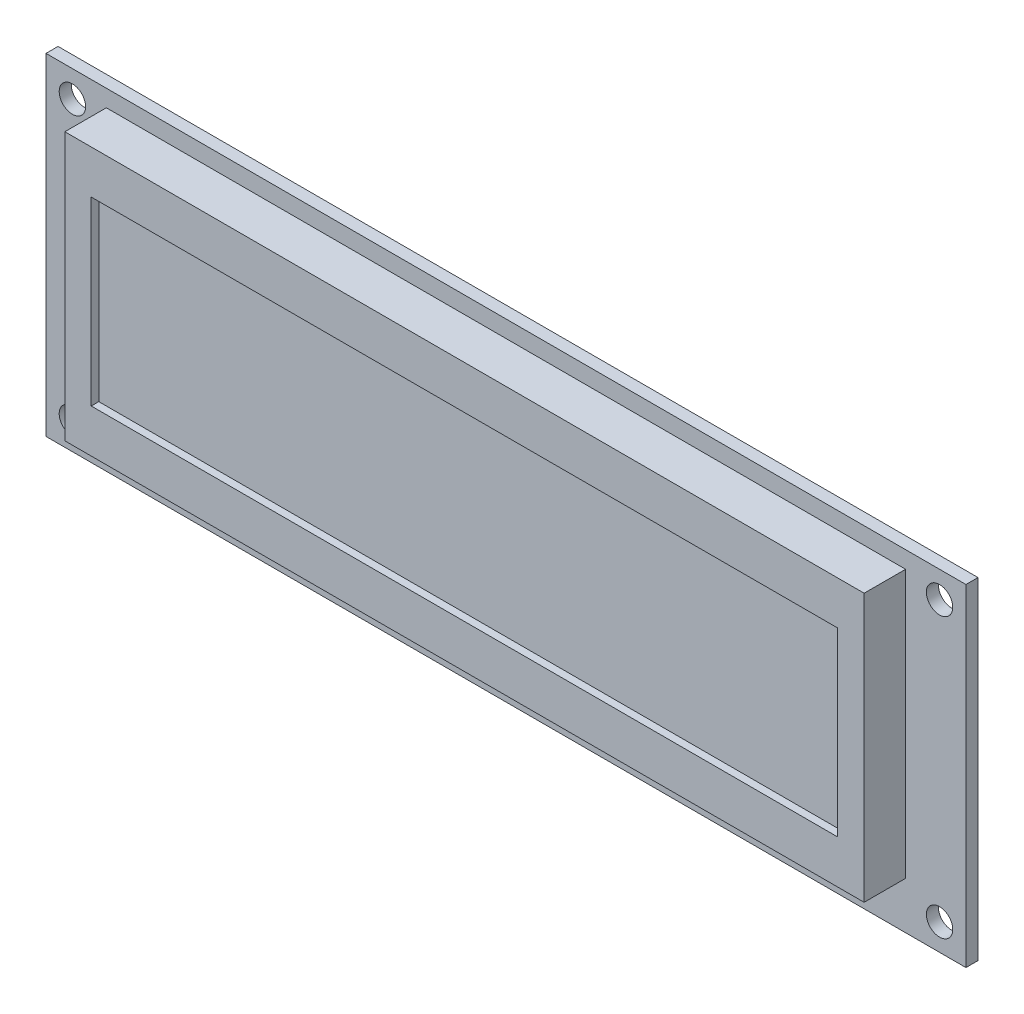
ISO-10303-21;
HEADER;
FILE_DESCRIPTION(('STEP AP214'),'2;1');
FILE_NAME('part.step','',(''),(''),'','','');
FILE_SCHEMA(('AUTOMOTIVE_DESIGN { 1 0 10303 214 1 1 1 1 }'));
ENDSEC;
DATA;
#1=APPLICATION_CONTEXT('core data for automotive mechanical design processes');
#2=APPLICATION_PROTOCOL_DEFINITION('international standard','automotive_design',2000,#1);
#3=PRODUCT_CONTEXT('',#1,'mechanical');
#4=PRODUCT('Part','Part','',(#3));
#5=PRODUCT_RELATED_PRODUCT_CATEGORY('part','',(#4));
#6=PRODUCT_DEFINITION_FORMATION('','',#4);
#7=PRODUCT_DEFINITION_CONTEXT('part definition',#1,'design');
#8=PRODUCT_DEFINITION('design','',#6,#7);
#9=PRODUCT_DEFINITION_SHAPE('','',#8);
#10=(LENGTH_UNIT() NAMED_UNIT(*) SI_UNIT(.MILLI.,.METRE.));
#11=(NAMED_UNIT(*) PLANE_ANGLE_UNIT() SI_UNIT($,.RADIAN.));
#12=(NAMED_UNIT(*) SI_UNIT($,.STERADIAN.) SOLID_ANGLE_UNIT());
#13=UNCERTAINTY_MEASURE_WITH_UNIT(LENGTH_MEASURE(1.E-05),#10,'distance_accuracy_value','');
#14=(GEOMETRIC_REPRESENTATION_CONTEXT(3) GLOBAL_UNCERTAINTY_ASSIGNED_CONTEXT((#13)) GLOBAL_UNIT_ASSIGNED_CONTEXT((#10,
#11,#12)) REPRESENTATION_CONTEXT('',''));
#15=CARTESIAN_POINT('',(0.,0.,0.));
#16=DIRECTION('',(0.,0.,1.));
#17=DIRECTION('',(1.,0.,0.));
#18=AXIS2_PLACEMENT_3D('',#15,#16,#17);
#19=CARTESIAN_POINT('',(61.,24.,6.1));
#20=DIRECTION('',(0.,0.,-1.));
#21=DIRECTION('',(-1.,0.,0.));
#22=AXIS2_PLACEMENT_3D('',#19,#20,#21);
#23=PLANE('',#22);
#24=DIRECTION('',(0.,1.,0.));
#25=VECTOR('',#24,1.);
#26=CARTESIAN_POINT('',(110.5,36.,6.1));
#27=LINE('',#26,#25);
#28=CARTESIAN_POINT('',(110.5,12.,6.1));
#29=VERTEX_POINT('',#28);
#30=CARTESIAN_POINT('',(110.5,36.,6.1));
#31=VERTEX_POINT('',#30);
#32=EDGE_CURVE('E110',#29,#31,#27,.T.);
#33=ORIENTED_EDGE('',*,*,#32,.T.);
#34=DIRECTION('',(1.,0.,0.));
#35=VECTOR('',#34,1.);
#36=CARTESIAN_POINT('',(11.5,36.,6.1));
#37=LINE('',#36,#35);
#38=CARTESIAN_POINT('',(11.5,36.,6.1));
#39=VERTEX_POINT('',#38);
#40=EDGE_CURVE('E304',#31,#39,#37,.F.);
#41=ORIENTED_EDGE('',*,*,#40,.T.);
#42=DIRECTION('',(0.,1.,0.));
#43=VECTOR('',#42,1.);
#44=CARTESIAN_POINT('',(11.5,12.,6.1));
#45=LINE('',#44,#43);
#46=CARTESIAN_POINT('',(11.5,12.,6.1));
#47=VERTEX_POINT('',#46);
#48=EDGE_CURVE('E122',#39,#47,#45,.F.);
#49=ORIENTED_EDGE('',*,*,#48,.T.);
#50=DIRECTION('',(1.,0.,0.));
#51=VECTOR('',#50,1.);
#52=CARTESIAN_POINT('',(110.5,12.,6.1));
#53=LINE('',#52,#51);
#54=EDGE_CURVE('E104',#47,#29,#53,.T.);
#55=ORIENTED_EDGE('',*,*,#54,.T.);
#56=EDGE_LOOP('',(#33,#41,#49,#55));
#57=FACE_BOUND('',#56,.T.);
#58=ADVANCED_FACE('F17',(#57),#23,.F.);
#59=CARTESIAN_POINT('',(110.5,36.,7.1));
#60=DIRECTION('',(1.,0.,0.));
#61=DIRECTION('',(0.,0.,-1.));
#62=AXIS2_PLACEMENT_3D('',#59,#60,#61);
#63=PLANE('',#62);
#64=DIRECTION('',(0.,0.,1.));
#65=VECTOR('',#64,1.);
#66=CARTESIAN_POINT('',(110.5,36.,7.1));
#67=LINE('',#66,#65);
#68=CARTESIAN_POINT('',(110.5,36.,7.1));
#69=VERTEX_POINT('',#68);
#70=EDGE_CURVE('E115',#69,#31,#67,.F.);
#71=ORIENTED_EDGE('',*,*,#70,.T.);
#72=ORIENTED_EDGE('',*,*,#32,.F.);
#73=DIRECTION('',(0.,0.,-1.));
#74=VECTOR('',#73,1.);
#75=CARTESIAN_POINT('',(110.5,12.,7.1));
#76=LINE('',#75,#74);
#77=CARTESIAN_POINT('',(110.5,12.,7.1));
#78=VERTEX_POINT('',#77);
#79=EDGE_CURVE('E113',#29,#78,#76,.F.);
#80=ORIENTED_EDGE('',*,*,#79,.T.);
#81=DIRECTION('',(0.,1.,0.));
#82=VECTOR('',#81,1.);
#83=CARTESIAN_POINT('',(110.5,24.,7.1));
#84=LINE('',#83,#82);
#85=EDGE_CURVE('E299',#69,#78,#84,.F.);
#86=ORIENTED_EDGE('',*,*,#85,.F.);
#87=EDGE_LOOP('',(#71,#72,#80,#86));
#88=FACE_BOUND('',#87,.T.);
#89=ADVANCED_FACE('F111',(#88),#63,.F.);
#90=CARTESIAN_POINT('',(110.5,12.,7.1));
#91=DIRECTION('',(0.,-1.,0.));
#92=DIRECTION('',(0.,0.,-1.));
#93=AXIS2_PLACEMENT_3D('',#90,#91,#92);
#94=PLANE('',#93);
#95=ORIENTED_EDGE('',*,*,#79,.F.);
#96=ORIENTED_EDGE('',*,*,#54,.F.);
#97=DIRECTION('',(0.,0.,1.));
#98=VECTOR('',#97,1.);
#99=CARTESIAN_POINT('',(11.5,12.,7.1));
#100=LINE('',#99,#98);
#101=CARTESIAN_POINT('',(11.5,12.,7.1));
#102=VERTEX_POINT('',#101);
#103=EDGE_CURVE('E307',#47,#102,#100,.T.);
#104=ORIENTED_EDGE('',*,*,#103,.T.);
#105=DIRECTION('',(1.,0.,0.));
#106=VECTOR('',#105,1.);
#107=CARTESIAN_POINT('',(61.,12.,7.1));
#108=LINE('',#107,#106);
#109=EDGE_CURVE('E121',#78,#102,#108,.F.);
#110=ORIENTED_EDGE('',*,*,#109,.F.);
#111=EDGE_LOOP('',(#95,#96,#104,#110));
#112=FACE_BOUND('',#111,.T.);
#113=ADVANCED_FACE('F120',(#112),#94,.F.);
#114=CARTESIAN_POINT('',(11.5,12.,7.1));
#115=DIRECTION('',(-1.,0.,0.));
#116=DIRECTION('',(0.,0.,1.));
#117=AXIS2_PLACEMENT_3D('',#114,#115,#116);
#118=PLANE('',#117);
#119=ORIENTED_EDGE('',*,*,#103,.F.);
#120=ORIENTED_EDGE('',*,*,#48,.F.);
#121=DIRECTION('',(0.,0.,1.));
#122=VECTOR('',#121,1.);
#123=CARTESIAN_POINT('',(11.5,36.,7.1));
#124=LINE('',#123,#122);
#125=CARTESIAN_POINT('',(11.5,36.,7.1));
#126=VERTEX_POINT('',#125);
#127=EDGE_CURVE('E301',#39,#126,#124,.T.);
#128=ORIENTED_EDGE('',*,*,#127,.T.);
#129=DIRECTION('',(0.,1.,0.));
#130=VECTOR('',#129,1.);
#131=CARTESIAN_POINT('',(11.5,24.,7.1));
#132=LINE('',#131,#130);
#133=EDGE_CURVE('E296',#102,#126,#132,.T.);
#134=ORIENTED_EDGE('',*,*,#133,.F.);
#135=EDGE_LOOP('',(#119,#120,#128,#134));
#136=FACE_BOUND('',#135,.T.);
#137=ADVANCED_FACE('F310',(#136),#118,.F.);
#138=CARTESIAN_POINT('',(11.5,36.,7.1));
#139=DIRECTION('',(0.,1.,0.));
#140=DIRECTION('',(0.,0.,1.));
#141=AXIS2_PLACEMENT_3D('',#138,#139,#140);
#142=PLANE('',#141);
#143=ORIENTED_EDGE('',*,*,#127,.F.);
#144=ORIENTED_EDGE('',*,*,#40,.F.);
#145=ORIENTED_EDGE('',*,*,#70,.F.);
#146=DIRECTION('',(1.,0.,0.));
#147=VECTOR('',#146,1.);
#148=CARTESIAN_POINT('',(61.,36.,7.1));
#149=LINE('',#148,#147);
#150=EDGE_CURVE('E293',#126,#69,#149,.T.);
#151=ORIENTED_EDGE('',*,*,#150,.F.);
#152=EDGE_LOOP('',(#143,#144,#145,#151));
#153=FACE_BOUND('',#152,.T.);
#154=ADVANCED_FACE('F317',(#153),#142,.F.);
#155=CARTESIAN_POINT('',(61.,24.,7.1));
#156=DIRECTION('',(0.,0.,1.));
#157=DIRECTION('',(1.,0.,0.));
#158=AXIS2_PLACEMENT_3D('',#155,#156,#157);
#159=PLANE('',#158);
#160=ORIENTED_EDGE('',*,*,#133,.T.);
#161=ORIENTED_EDGE('',*,*,#150,.T.);
#162=ORIENTED_EDGE('',*,*,#85,.T.);
#163=ORIENTED_EDGE('',*,*,#109,.T.);
#164=EDGE_LOOP('',(#160,#161,#162,#163));
#165=FACE_BOUND('',#164,.T.);
#166=DIRECTION('',(1.,0.,0.));
#167=VECTOR('',#166,1.);
#168=CARTESIAN_POINT('',(114.,41.75,7.1));
#169=LINE('',#168,#167);
#170=CARTESIAN_POINT('',(8.,41.75,7.1));
#171=VERTEX_POINT('',#170);
#172=CARTESIAN_POINT('',(114.,41.75,7.1));
#173=VERTEX_POINT('',#172);
#174=EDGE_CURVE('E281',#171,#173,#169,.T.);
#175=ORIENTED_EDGE('',*,*,#174,.F.);
#176=DIRECTION('',(0.,1.,0.));
#177=VECTOR('',#176,1.);
#178=CARTESIAN_POINT('',(8.,41.75,7.1));
#179=LINE('',#178,#177);
#180=CARTESIAN_POINT('',(8.00000000000001,6.25,7.1));
#181=VERTEX_POINT('',#180);
#182=EDGE_CURVE('E286',#181,#171,#179,.T.);
#183=ORIENTED_EDGE('',*,*,#182,.F.);
#184=DIRECTION('',(1.,0.,0.));
#185=VECTOR('',#184,1.);
#186=CARTESIAN_POINT('',(8.00000000000001,6.25,7.1));
#187=LINE('',#186,#185);
#188=CARTESIAN_POINT('',(114.,6.25,7.1));
#189=VERTEX_POINT('',#188);
#190=EDGE_CURVE('E291',#189,#181,#187,.F.);
#191=ORIENTED_EDGE('',*,*,#190,.F.);
#192=DIRECTION('',(0.,1.,0.));
#193=VECTOR('',#192,1.);
#194=CARTESIAN_POINT('',(114.,6.25,7.1));
#195=LINE('',#194,#193);
#196=EDGE_CURVE('E276',#173,#189,#195,.F.);
#197=ORIENTED_EDGE('',*,*,#196,.F.);
#198=EDGE_LOOP('',(#175,#183,#191,#197));
#199=FACE_BOUND('',#198,.T.);
#200=ADVANCED_FACE('F314',(#165,#199),#159,.T.);
#201=CARTESIAN_POINT('',(8.00000000000001,6.25,0.));
#202=DIRECTION('',(0.,-1.,0.));
#203=DIRECTION('',(0.,0.,-1.));
#204=AXIS2_PLACEMENT_3D('',#201,#202,#203);
#205=PLANE('',#204);
#206=ORIENTED_EDGE('',*,*,#190,.T.);
#207=DIRECTION('',(0.,0.,1.));
#208=VECTOR('',#207,1.);
#209=CARTESIAN_POINT('',(8.,6.25,0.));
#210=LINE('',#209,#208);
#211=CARTESIAN_POINT('',(8.00000000000001,6.25,1.6));
#212=VERTEX_POINT('',#211);
#213=EDGE_CURVE('E288',#212,#181,#210,.T.);
#214=ORIENTED_EDGE('',*,*,#213,.F.);
#215=DIRECTION('',(1.,0.,0.));
#216=VECTOR('',#215,1.);
#217=CARTESIAN_POINT('',(61.,6.25,1.6));
#218=LINE('',#217,#216);
#219=CARTESIAN_POINT('',(114.,6.25,1.6));
#220=VERTEX_POINT('',#219);
#221=EDGE_CURVE('E272',#220,#212,#218,.F.);
#222=ORIENTED_EDGE('',*,*,#221,.F.);
#223=DIRECTION('',(0.,0.,-1.));
#224=VECTOR('',#223,1.);
#225=CARTESIAN_POINT('',(114.,6.25,0.));
#226=LINE('',#225,#224);
#227=EDGE_CURVE('E274',#189,#220,#226,.T.);
#228=ORIENTED_EDGE('',*,*,#227,.F.);
#229=EDGE_LOOP('',(#206,#214,#222,#228));
#230=FACE_BOUND('',#229,.T.);
#231=ADVANCED_FACE('F325',(#230),#205,.T.);
#232=CARTESIAN_POINT('',(8.,41.75,0.));
#233=DIRECTION('',(-1.,0.,0.));
#234=DIRECTION('',(0.,0.,1.));
#235=AXIS2_PLACEMENT_3D('',#232,#233,#234);
#236=PLANE('',#235);
#237=ORIENTED_EDGE('',*,*,#182,.T.);
#238=DIRECTION('',(0.,0.,1.));
#239=VECTOR('',#238,1.);
#240=CARTESIAN_POINT('',(7.99999999999999,41.75,0.));
#241=LINE('',#240,#239);
#242=CARTESIAN_POINT('',(8.,41.75,1.6));
#243=VERTEX_POINT('',#242);
#244=EDGE_CURVE('E283',#243,#171,#241,.T.);
#245=ORIENTED_EDGE('',*,*,#244,.F.);
#246=DIRECTION('',(0.,1.,0.));
#247=VECTOR('',#246,1.);
#248=CARTESIAN_POINT('',(8.,22.,1.6));
#249=LINE('',#248,#247);
#250=EDGE_CURVE('E270',#212,#243,#249,.T.);
#251=ORIENTED_EDGE('',*,*,#250,.F.);
#252=ORIENTED_EDGE('',*,*,#213,.T.);
#253=EDGE_LOOP('',(#237,#245,#251,#252));
#254=FACE_BOUND('',#253,.T.);
#255=ADVANCED_FACE('F443',(#254),#236,.T.);
#256=CARTESIAN_POINT('',(114.,41.75,0.));
#257=DIRECTION('',(0.,1.,0.));
#258=DIRECTION('',(0.,0.,1.));
#259=AXIS2_PLACEMENT_3D('',#256,#257,#258);
#260=PLANE('',#259);
#261=ORIENTED_EDGE('',*,*,#174,.T.);
#262=DIRECTION('',(0.,0.,-1.));
#263=VECTOR('',#262,1.);
#264=CARTESIAN_POINT('',(114.,41.75,0.));
#265=LINE('',#264,#263);
#266=CARTESIAN_POINT('',(114.,41.75,1.6));
#267=VERTEX_POINT('',#266);
#268=EDGE_CURVE('E278',#267,#173,#265,.F.);
#269=ORIENTED_EDGE('',*,*,#268,.F.);
#270=DIRECTION('',(1.,0.,0.));
#271=VECTOR('',#270,1.);
#272=CARTESIAN_POINT('',(61.,41.75,1.6));
#273=LINE('',#272,#271);
#274=EDGE_CURVE('E268',#243,#267,#273,.T.);
#275=ORIENTED_EDGE('',*,*,#274,.F.);
#276=ORIENTED_EDGE('',*,*,#244,.T.);
#277=EDGE_LOOP('',(#261,#269,#275,#276));
#278=FACE_BOUND('',#277,.T.);
#279=ADVANCED_FACE('F439',(#278),#260,.T.);
#280=CARTESIAN_POINT('',(114.,6.25,0.));
#281=DIRECTION('',(1.,0.,0.));
#282=DIRECTION('',(0.,0.,-1.));
#283=AXIS2_PLACEMENT_3D('',#280,#281,#282);
#284=PLANE('',#283);
#285=ORIENTED_EDGE('',*,*,#196,.T.);
#286=ORIENTED_EDGE('',*,*,#227,.T.);
#287=DIRECTION('',(0.,1.,0.));
#288=VECTOR('',#287,1.);
#289=CARTESIAN_POINT('',(114.,22.,1.6));
#290=LINE('',#289,#288);
#291=EDGE_CURVE('E265',#267,#220,#290,.F.);
#292=ORIENTED_EDGE('',*,*,#291,.F.);
#293=ORIENTED_EDGE('',*,*,#268,.T.);
#294=EDGE_LOOP('',(#285,#286,#292,#293));
#295=FACE_BOUND('',#294,.T.);
#296=ADVANCED_FACE('F435',(#295),#284,.T.);
#297=CARTESIAN_POINT('',(61.,22.,1.6));
#298=DIRECTION('',(0.,0.,1.));
#299=DIRECTION('',(1.,0.,0.));
#300=AXIS2_PLACEMENT_3D('',#297,#298,#299);
#301=PLANE('',#300);
#302=CARTESIAN_POINT('',(16.06,2.5,1.6));
#303=DIRECTION('',(0.,0.,1.));
#304=DIRECTION('',(1.,0.,0.));
#305=AXIS2_PLACEMENT_3D('',#302,#303,#304);
#306=CIRCLE('',#305,0.5);
#307=CARTESIAN_POINT('',(16.56,2.5,1.6));
#308=VERTEX_POINT('',#307);
#309=EDGE_CURVE('E185',#308,#308,#306,.F.);
#310=ORIENTED_EDGE('',*,*,#309,.T.);
#311=EDGE_LOOP('',(#310));
#312=FACE_BOUND('',#311,.T.);
#313=CARTESIAN_POINT('',(18.6,2.5,1.6));
#314=DIRECTION('',(0.,0.,1.));
#315=DIRECTION('',(1.,0.,0.));
#316=AXIS2_PLACEMENT_3D('',#313,#314,#315);
#317=CIRCLE('',#316,0.5);
#318=CARTESIAN_POINT('',(19.1,2.5,1.6));
#319=VERTEX_POINT('',#318);
#320=EDGE_CURVE('E189',#319,#319,#317,.F.);
#321=ORIENTED_EDGE('',*,*,#320,.T.);
#322=EDGE_LOOP('',(#321));
#323=FACE_BOUND('',#322,.T.);
#324=CARTESIAN_POINT('',(3.5,40.5,1.6));
#325=DIRECTION('',(0.,0.,1.));
#326=DIRECTION('',(1.,0.,0.));
#327=AXIS2_PLACEMENT_3D('',#324,#325,#326);
#328=CIRCLE('',#327,1.75);
#329=CARTESIAN_POINT('',(5.25,40.5,1.6));
#330=VERTEX_POINT('',#329);
#331=EDGE_CURVE('E192',#330,#330,#328,.F.);
#332=ORIENTED_EDGE('',*,*,#331,.T.);
#333=EDGE_LOOP('',(#332));
#334=FACE_BOUND('',#333,.T.);
#335=CARTESIAN_POINT('',(118.5,40.5,1.6));
#336=DIRECTION('',(0.,0.,1.));
#337=DIRECTION('',(1.,0.,0.));
#338=AXIS2_PLACEMENT_3D('',#335,#336,#337);
#339=CIRCLE('',#338,1.75000000000001);
#340=CARTESIAN_POINT('',(120.25,40.5,1.6));
#341=VERTEX_POINT('',#340);
#342=EDGE_CURVE('E195',#341,#341,#339,.F.);
#343=ORIENTED_EDGE('',*,*,#342,.T.);
#344=EDGE_LOOP('',(#343));
#345=FACE_BOUND('',#344,.T.);
#346=CARTESIAN_POINT('',(3.5,3.50000000000001,1.6));
#347=DIRECTION('',(0.,0.,1.));
#348=DIRECTION('',(1.,0.,0.));
#349=AXIS2_PLACEMENT_3D('',#346,#347,#348);
#350=CIRCLE('',#349,1.75);
#351=CARTESIAN_POINT('',(5.25,3.50000000000001,1.6));
#352=VERTEX_POINT('',#351);
#353=EDGE_CURVE('E198',#352,#352,#350,.F.);
#354=ORIENTED_EDGE('',*,*,#353,.T.);
#355=EDGE_LOOP('',(#354));
#356=FACE_BOUND('',#355,.T.);
#357=ORIENTED_EDGE('',*,*,#274,.T.);
#358=ORIENTED_EDGE('',*,*,#291,.T.);
#359=ORIENTED_EDGE('',*,*,#221,.T.);
#360=ORIENTED_EDGE('',*,*,#250,.T.);
#361=EDGE_LOOP('',(#357,#358,#359,#360));
#362=FACE_BOUND('',#361,.T.);
#363=CARTESIAN_POINT('',(118.5,3.50000000000001,1.6));
#364=DIRECTION('',(0.,0.,1.));
#365=DIRECTION('',(1.,0.,0.));
#366=AXIS2_PLACEMENT_3D('',#363,#364,#365);
#367=CIRCLE('',#366,1.75000000000001);
#368=CARTESIAN_POINT('',(120.25,3.50000000000001,1.6));
#369=VERTEX_POINT('',#368);
#370=EDGE_CURVE('E201',#369,#369,#367,.F.);
#371=ORIENTED_EDGE('',*,*,#370,.T.);
#372=EDGE_LOOP('',(#371));
#373=FACE_BOUND('',#372,.T.);
#374=CARTESIAN_POINT('',(49.08,2.5,1.6));
#375=DIRECTION('',(0.,0.,1.));
#376=DIRECTION('',(1.,0.,0.));
#377=AXIS2_PLACEMENT_3D('',#374,#375,#376);
#378=CIRCLE('',#377,0.499999999999998);
#379=CARTESIAN_POINT('',(49.58,2.5,1.6));
#380=VERTEX_POINT('',#379);
#381=EDGE_CURVE('E204',#380,#380,#378,.F.);
#382=ORIENTED_EDGE('',*,*,#381,.T.);
#383=EDGE_LOOP('',(#382));
#384=FACE_BOUND('',#383,.T.);
#385=CARTESIAN_POINT('',(13.52,2.5,1.6));
#386=DIRECTION('',(0.,0.,1.));
#387=DIRECTION('',(1.,0.,0.));
#388=AXIS2_PLACEMENT_3D('',#385,#386,#387);
#389=CIRCLE('',#388,0.5);
#390=CARTESIAN_POINT('',(14.02,2.5,1.6));
#391=VERTEX_POINT('',#390);
#392=EDGE_CURVE('E207',#391,#391,#389,.F.);
#393=ORIENTED_EDGE('',*,*,#392,.T.);
#394=EDGE_LOOP('',(#393));
#395=FACE_BOUND('',#394,.T.);
#396=CARTESIAN_POINT('',(10.98,2.5,1.6));
#397=DIRECTION('',(0.,0.,1.));
#398=DIRECTION('',(1.,0.,0.));
#399=AXIS2_PLACEMENT_3D('',#396,#397,#398);
#400=CIRCLE('',#399,0.5);
#401=CARTESIAN_POINT('',(11.48,2.5,1.6));
#402=VERTEX_POINT('',#401);
#403=EDGE_CURVE('E210',#402,#402,#400,.F.);
#404=ORIENTED_EDGE('',*,*,#403,.T.);
#405=EDGE_LOOP('',(#404));
#406=FACE_BOUND('',#405,.T.);
#407=CARTESIAN_POINT('',(33.84,2.5,1.6));
#408=DIRECTION('',(0.,0.,1.));
#409=DIRECTION('',(1.,0.,0.));
#410=AXIS2_PLACEMENT_3D('',#407,#408,#409);
#411=CIRCLE('',#410,0.499999999999998);
#412=CARTESIAN_POINT('',(34.34,2.5,1.6));
#413=VERTEX_POINT('',#412);
#414=EDGE_CURVE('E213',#413,#413,#411,.F.);
#415=ORIENTED_EDGE('',*,*,#414,.T.);
#416=EDGE_LOOP('',(#415));
#417=FACE_BOUND('',#416,.T.);
#418=CARTESIAN_POINT('',(31.3,2.5,1.6));
#419=DIRECTION('',(0.,0.,1.));
#420=DIRECTION('',(1.,0.,0.));
#421=AXIS2_PLACEMENT_3D('',#418,#419,#420);
#422=CIRCLE('',#421,0.499999999999998);
#423=CARTESIAN_POINT('',(31.8,2.5,1.6));
#424=VERTEX_POINT('',#423);
#425=EDGE_CURVE('E216',#424,#424,#422,.F.);
#426=ORIENTED_EDGE('',*,*,#425,.T.);
#427=EDGE_LOOP('',(#426));
#428=FACE_BOUND('',#427,.T.);
#429=CARTESIAN_POINT('',(28.76,2.5,1.6));
#430=DIRECTION('',(0.,0.,1.));
#431=DIRECTION('',(1.,0.,0.));
#432=AXIS2_PLACEMENT_3D('',#429,#430,#431);
#433=CIRCLE('',#432,0.499999999999998);
#434=CARTESIAN_POINT('',(29.26,2.5,1.6));
#435=VERTEX_POINT('',#434);
#436=EDGE_CURVE('E219',#435,#435,#433,.F.);
#437=ORIENTED_EDGE('',*,*,#436,.T.);
#438=EDGE_LOOP('',(#437));
#439=FACE_BOUND('',#438,.T.);
#440=CARTESIAN_POINT('',(21.14,2.5,1.6));
#441=DIRECTION('',(0.,0.,1.));
#442=DIRECTION('',(1.,0.,0.));
#443=AXIS2_PLACEMENT_3D('',#440,#441,#442);
#444=CIRCLE('',#443,0.499999999999998);
#445=CARTESIAN_POINT('',(21.64,2.5,1.6));
#446=VERTEX_POINT('',#445);
#447=EDGE_CURVE('E222',#446,#446,#444,.F.);
#448=ORIENTED_EDGE('',*,*,#447,.T.);
#449=EDGE_LOOP('',(#448));
#450=FACE_BOUND('',#449,.T.);
#451=CARTESIAN_POINT('',(23.68,2.5,1.6));
#452=DIRECTION('',(0.,0.,1.));
#453=DIRECTION('',(1.,0.,0.));
#454=AXIS2_PLACEMENT_3D('',#451,#452,#453);
#455=CIRCLE('',#454,0.499999999999998);
#456=CARTESIAN_POINT('',(24.18,2.5,1.6));
#457=VERTEX_POINT('',#456);
#458=EDGE_CURVE('E225',#457,#457,#455,.F.);
#459=ORIENTED_EDGE('',*,*,#458,.T.);
#460=EDGE_LOOP('',(#459));
#461=FACE_BOUND('',#460,.T.);
#462=CARTESIAN_POINT('',(26.22,2.5,1.6));
#463=DIRECTION('',(0.,0.,1.));
#464=DIRECTION('',(1.,0.,0.));
#465=AXIS2_PLACEMENT_3D('',#462,#463,#464);
#466=CIRCLE('',#465,0.499999999999998);
#467=CARTESIAN_POINT('',(26.72,2.5,1.6));
#468=VERTEX_POINT('',#467);
#469=EDGE_CURVE('E228',#468,#468,#466,.F.);
#470=ORIENTED_EDGE('',*,*,#469,.T.);
#471=EDGE_LOOP('',(#470));
#472=FACE_BOUND('',#471,.T.);
#473=CARTESIAN_POINT('',(41.46,2.5,1.6));
#474=DIRECTION('',(0.,0.,1.));
#475=DIRECTION('',(1.,0.,0.));
#476=AXIS2_PLACEMENT_3D('',#473,#474,#475);
#477=CIRCLE('',#476,0.499999999999998);
#478=CARTESIAN_POINT('',(41.96,2.5,1.6));
#479=VERTEX_POINT('',#478);
#480=EDGE_CURVE('E231',#479,#479,#477,.F.);
#481=ORIENTED_EDGE('',*,*,#480,.T.);
#482=EDGE_LOOP('',(#481));
#483=FACE_BOUND('',#482,.T.);
#484=CARTESIAN_POINT('',(38.92,2.5,1.6));
#485=DIRECTION('',(0.,0.,1.));
#486=DIRECTION('',(1.,0.,0.));
#487=AXIS2_PLACEMENT_3D('',#484,#485,#486);
#488=CIRCLE('',#487,0.499999999999998);
#489=CARTESIAN_POINT('',(39.42,2.5,1.6));
#490=VERTEX_POINT('',#489);
#491=EDGE_CURVE('E234',#490,#490,#488,.F.);
#492=ORIENTED_EDGE('',*,*,#491,.T.);
#493=EDGE_LOOP('',(#492));
#494=FACE_BOUND('',#493,.T.);
#495=CARTESIAN_POINT('',(36.38,2.5,1.6));
#496=DIRECTION('',(0.,0.,1.));
#497=DIRECTION('',(1.,0.,0.));
#498=AXIS2_PLACEMENT_3D('',#495,#496,#497);
#499=CIRCLE('',#498,0.499999999999998);
#500=CARTESIAN_POINT('',(36.88,2.5,1.6));
#501=VERTEX_POINT('',#500);
#502=EDGE_CURVE('E237',#501,#501,#499,.F.);
#503=ORIENTED_EDGE('',*,*,#502,.T.);
#504=EDGE_LOOP('',(#503));
#505=FACE_BOUND('',#504,.T.);
#506=CARTESIAN_POINT('',(44.,2.5,1.6));
#507=DIRECTION('',(0.,0.,1.));
#508=DIRECTION('',(1.,0.,0.));
#509=AXIS2_PLACEMENT_3D('',#506,#507,#508);
#510=CIRCLE('',#509,0.499999999999998);
#511=CARTESIAN_POINT('',(44.5,2.5,1.6));
#512=VERTEX_POINT('',#511);
#513=EDGE_CURVE('E239',#512,#512,#510,.F.);
#514=ORIENTED_EDGE('',*,*,#513,.T.);
#515=EDGE_LOOP('',(#514));
#516=FACE_BOUND('',#515,.T.);
#517=CARTESIAN_POINT('',(46.54,2.5,1.6));
#518=DIRECTION('',(0.,0.,1.));
#519=DIRECTION('',(1.,0.,0.));
#520=AXIS2_PLACEMENT_3D('',#517,#518,#519);
#521=CIRCLE('',#520,0.499999999999998);
#522=CARTESIAN_POINT('',(47.04,2.5,1.6));
#523=VERTEX_POINT('',#522);
#524=EDGE_CURVE('E20',#523,#523,#521,.F.);
#525=ORIENTED_EDGE('',*,*,#524,.T.);
#526=EDGE_LOOP('',(#525));
#527=FACE_BOUND('',#526,.T.);
#528=DIRECTION('',(0.,1.,0.));
#529=VECTOR('',#528,1.);
#530=CARTESIAN_POINT('',(122.,0.,1.6));
#531=LINE('',#530,#529);
#532=CARTESIAN_POINT('',(122.,44.,1.6));
#533=VERTEX_POINT('',#532);
#534=CARTESIAN_POINT('',(122.,0.,1.6));
#535=VERTEX_POINT('',#534);
#536=EDGE_CURVE('E261',#533,#535,#531,.F.);
#537=ORIENTED_EDGE('',*,*,#536,.F.);
#538=DIRECTION('',(1.,0.,0.));
#539=VECTOR('',#538,1.);
#540=CARTESIAN_POINT('',(122.,44.,1.6));
#541=LINE('',#540,#539);
#542=CARTESIAN_POINT('',(0.,44.,1.6));
#543=VERTEX_POINT('',#542);
#544=EDGE_CURVE('E257',#543,#533,#541,.T.);
#545=ORIENTED_EDGE('',*,*,#544,.F.);
#546=DIRECTION('',(0.,1.,0.));
#547=VECTOR('',#546,1.);
#548=CARTESIAN_POINT('',(0.,44.,1.6));
#549=LINE('',#548,#547);
#550=CARTESIAN_POINT('',(0.,0.,1.6));
#551=VERTEX_POINT('',#550);
#552=EDGE_CURVE('E246',#551,#543,#549,.T.);
#553=ORIENTED_EDGE('',*,*,#552,.F.);
#554=DIRECTION('',(1.,0.,0.));
#555=VECTOR('',#554,1.);
#556=CARTESIAN_POINT('',(0.,0.,1.6));
#557=LINE('',#556,#555);
#558=EDGE_CURVE('E263',#535,#551,#557,.F.);
#559=ORIENTED_EDGE('',*,*,#558,.F.);
#560=EDGE_LOOP('',(#537,#545,#553,#559));
#561=FACE_BOUND('',#560,.T.);
#562=ADVANCED_FACE('F431',(#312,#323,#334,#345,#356,#362,#373,#384,#395,#406,#417,#428,#439,
#450,#461,#472,#483,#494,#505,#516,#527,#561),#301,.T.);
#563=CARTESIAN_POINT('',(0.,0.,0.));
#564=DIRECTION('',(0.,-1.,0.));
#565=DIRECTION('',(0.,0.,-1.));
#566=AXIS2_PLACEMENT_3D('',#563,#564,#565);
#567=PLANE('',#566);
#568=ORIENTED_EDGE('',*,*,#558,.T.);
#569=DIRECTION('',(0.,0.,1.));
#570=VECTOR('',#569,1.);
#571=CARTESIAN_POINT('',(0.,0.,0.));
#572=LINE('',#571,#570);
#573=CARTESIAN_POINT('',(0.,0.,0.));
#574=VERTEX_POINT('',#573);
#575=EDGE_CURVE('E248',#574,#551,#572,.T.);
#576=ORIENTED_EDGE('',*,*,#575,.F.);
#577=DIRECTION('',(1.,0.,0.));
#578=VECTOR('',#577,1.);
#579=CARTESIAN_POINT('',(61.,0.,0.));
#580=LINE('',#579,#578);
#581=CARTESIAN_POINT('',(122.,0.,0.));
#582=VERTEX_POINT('',#581);
#583=EDGE_CURVE('E188',#574,#582,#580,.T.);
#584=ORIENTED_EDGE('',*,*,#583,.T.);
#585=DIRECTION('',(0.,0.,-1.));
#586=VECTOR('',#585,1.);
#587=CARTESIAN_POINT('',(122.,0.,0.));
#588=LINE('',#587,#586);
#589=EDGE_CURVE('E259',#535,#582,#588,.T.);
#590=ORIENTED_EDGE('',*,*,#589,.F.);
#591=EDGE_LOOP('',(#568,#576,#584,#590));
#592=FACE_BOUND('',#591,.T.);
#593=ADVANCED_FACE('F427',(#592),#567,.T.);
#594=CARTESIAN_POINT('',(122.,0.,0.));
#595=DIRECTION('',(1.,0.,0.));
#596=DIRECTION('',(0.,0.,-1.));
#597=AXIS2_PLACEMENT_3D('',#594,#595,#596);
#598=PLANE('',#597);
#599=ORIENTED_EDGE('',*,*,#536,.T.);
#600=ORIENTED_EDGE('',*,*,#589,.T.);
#601=DIRECTION('',(0.,1.,0.));
#602=VECTOR('',#601,1.);
#603=CARTESIAN_POINT('',(122.,22.,0.));
#604=LINE('',#603,#602);
#605=CARTESIAN_POINT('',(122.,44.,0.));
#606=VERTEX_POINT('',#605);
#607=EDGE_CURVE('E500',#582,#606,#604,.T.);
#608=ORIENTED_EDGE('',*,*,#607,.T.);
#609=DIRECTION('',(0.,0.,1.));
#610=VECTOR('',#609,1.);
#611=CARTESIAN_POINT('',(122.,44.,0.));
#612=LINE('',#611,#610);
#613=EDGE_CURVE('E255',#533,#606,#612,.F.);
#614=ORIENTED_EDGE('',*,*,#613,.F.);
#615=EDGE_LOOP('',(#599,#600,#608,#614));
#616=FACE_BOUND('',#615,.T.);
#617=ADVANCED_FACE('F423',(#616),#598,.T.);
#618=CARTESIAN_POINT('',(122.,44.,0.));
#619=DIRECTION('',(0.,1.,0.));
#620=DIRECTION('',(0.,0.,1.));
#621=AXIS2_PLACEMENT_3D('',#618,#619,#620);
#622=PLANE('',#621);
#623=ORIENTED_EDGE('',*,*,#544,.T.);
#624=ORIENTED_EDGE('',*,*,#613,.T.);
#625=DIRECTION('',(1.,0.,0.));
#626=VECTOR('',#625,1.);
#627=CARTESIAN_POINT('',(61.,44.,0.));
#628=LINE('',#627,#626);
#629=CARTESIAN_POINT('',(0.,44.,0.));
#630=VERTEX_POINT('',#629);
#631=EDGE_CURVE('E503',#606,#630,#628,.F.);
#632=ORIENTED_EDGE('',*,*,#631,.T.);
#633=DIRECTION('',(0.,0.,1.));
#634=VECTOR('',#633,1.);
#635=CARTESIAN_POINT('',(0.,44.,0.));
#636=LINE('',#635,#634);
#637=EDGE_CURVE('E35',#543,#630,#636,.F.);
#638=ORIENTED_EDGE('',*,*,#637,.F.);
#639=EDGE_LOOP('',(#623,#624,#632,#638));
#640=FACE_BOUND('',#639,.T.);
#641=ADVANCED_FACE('F420',(#640),#622,.T.);
#642=CARTESIAN_POINT('',(0.,44.,0.));
#643=DIRECTION('',(-1.,0.,0.));
#644=DIRECTION('',(0.,0.,1.));
#645=AXIS2_PLACEMENT_3D('',#642,#643,#644);
#646=PLANE('',#645);
#647=ORIENTED_EDGE('',*,*,#552,.T.);
#648=ORIENTED_EDGE('',*,*,#637,.T.);
#649=DIRECTION('',(0.,1.,0.));
#650=VECTOR('',#649,1.);
#651=CARTESIAN_POINT('',(0.,22.,0.));
#652=LINE('',#651,#650);
#653=EDGE_CURVE('E184',#630,#574,#652,.F.);
#654=ORIENTED_EDGE('',*,*,#653,.T.);
#655=ORIENTED_EDGE('',*,*,#575,.T.);
#656=EDGE_LOOP('',(#647,#648,#654,#655));
#657=FACE_BOUND('',#656,.T.);
#658=ADVANCED_FACE('F416',(#657),#646,.T.);
#659=CARTESIAN_POINT('',(46.54,2.5,0.));
#660=DIRECTION('',(0.,0.,1.));
#661=DIRECTION('',(1.,0.,0.));
#662=AXIS2_PLACEMENT_3D('',#659,#660,#661);
#663=CYLINDRICAL_SURFACE('',#662,0.499999999999998);
#664=CARTESIAN_POINT('',(46.54,2.5,0.));
#665=DIRECTION('',(0.,0.,1.));
#666=DIRECTION('',(1.,0.,0.));
#667=AXIS2_PLACEMENT_3D('',#664,#665,#666);
#668=CIRCLE('',#667,0.499999999999998);
#669=CARTESIAN_POINT('',(47.04,2.5,0.));
#670=VERTEX_POINT('',#669);
#671=EDGE_CURVE('E181',#670,#670,#668,.F.);
#672=ORIENTED_EDGE('',*,*,#671,.T.);
#673=EDGE_LOOP('',(#672));
#674=FACE_BOUND('',#673,.T.);
#675=ORIENTED_EDGE('',*,*,#524,.F.);
#676=EDGE_LOOP('',(#675));
#677=FACE_BOUND('',#676,.T.);
#678=ADVANCED_FACE('F412',(#674,#677),#663,.F.);
#679=CARTESIAN_POINT('',(44.,2.5,0.));
#680=DIRECTION('',(0.,0.,1.));
#681=DIRECTION('',(1.,0.,0.));
#682=AXIS2_PLACEMENT_3D('',#679,#680,#681);
#683=CYLINDRICAL_SURFACE('',#682,0.499999999999998);
#684=CARTESIAN_POINT('',(44.,2.5,0.));
#685=DIRECTION('',(0.,0.,1.));
#686=DIRECTION('',(1.,0.,0.));
#687=AXIS2_PLACEMENT_3D('',#684,#685,#686);
#688=CIRCLE('',#687,0.499999999999998);
#689=CARTESIAN_POINT('',(44.5,2.5,0.));
#690=VERTEX_POINT('',#689);
#691=EDGE_CURVE('E178',#690,#690,#688,.F.);
#692=ORIENTED_EDGE('',*,*,#691,.T.);
#693=EDGE_LOOP('',(#692));
#694=FACE_BOUND('',#693,.T.);
#695=ORIENTED_EDGE('',*,*,#513,.F.);
#696=EDGE_LOOP('',(#695));
#697=FACE_BOUND('',#696,.T.);
#698=ADVANCED_FACE('F408',(#694,#697),#683,.F.);
#699=CARTESIAN_POINT('',(36.38,2.5,0.));
#700=DIRECTION('',(0.,0.,1.));
#701=DIRECTION('',(1.,0.,0.));
#702=AXIS2_PLACEMENT_3D('',#699,#700,#701);
#703=CYLINDRICAL_SURFACE('',#702,0.499999999999998);
#704=CARTESIAN_POINT('',(36.38,2.5,0.));
#705=DIRECTION('',(0.,0.,1.));
#706=DIRECTION('',(1.,0.,0.));
#707=AXIS2_PLACEMENT_3D('',#704,#705,#706);
#708=CIRCLE('',#707,0.499999999999998);
#709=CARTESIAN_POINT('',(36.88,2.5,0.));
#710=VERTEX_POINT('',#709);
#711=EDGE_CURVE('E175',#710,#710,#708,.F.);
#712=ORIENTED_EDGE('',*,*,#711,.T.);
#713=EDGE_LOOP('',(#712));
#714=FACE_BOUND('',#713,.T.);
#715=ORIENTED_EDGE('',*,*,#502,.F.);
#716=EDGE_LOOP('',(#715));
#717=FACE_BOUND('',#716,.T.);
#718=ADVANCED_FACE('F404',(#714,#717),#703,.F.);
#719=CARTESIAN_POINT('',(38.92,2.5,0.));
#720=DIRECTION('',(0.,0.,1.));
#721=DIRECTION('',(1.,0.,0.));
#722=AXIS2_PLACEMENT_3D('',#719,#720,#721);
#723=CYLINDRICAL_SURFACE('',#722,0.499999999999998);
#724=CARTESIAN_POINT('',(38.92,2.5,0.));
#725=DIRECTION('',(0.,0.,1.));
#726=DIRECTION('',(1.,0.,0.));
#727=AXIS2_PLACEMENT_3D('',#724,#725,#726);
#728=CIRCLE('',#727,0.499999999999998);
#729=CARTESIAN_POINT('',(39.42,2.5,0.));
#730=VERTEX_POINT('',#729);
#731=EDGE_CURVE('E172',#730,#730,#728,.F.);
#732=ORIENTED_EDGE('',*,*,#731,.T.);
#733=EDGE_LOOP('',(#732));
#734=FACE_BOUND('',#733,.T.);
#735=ORIENTED_EDGE('',*,*,#491,.F.);
#736=EDGE_LOOP('',(#735));
#737=FACE_BOUND('',#736,.T.);
#738=ADVANCED_FACE('F400',(#734,#737),#723,.F.);
#739=CARTESIAN_POINT('',(41.46,2.5,0.));
#740=DIRECTION('',(0.,0.,1.));
#741=DIRECTION('',(1.,0.,0.));
#742=AXIS2_PLACEMENT_3D('',#739,#740,#741);
#743=CYLINDRICAL_SURFACE('',#742,0.499999999999998);
#744=CARTESIAN_POINT('',(41.46,2.5,0.));
#745=DIRECTION('',(0.,0.,1.));
#746=DIRECTION('',(1.,0.,0.));
#747=AXIS2_PLACEMENT_3D('',#744,#745,#746);
#748=CIRCLE('',#747,0.499999999999998);
#749=CARTESIAN_POINT('',(41.96,2.5,0.));
#750=VERTEX_POINT('',#749);
#751=EDGE_CURVE('E169',#750,#750,#748,.F.);
#752=ORIENTED_EDGE('',*,*,#751,.T.);
#753=EDGE_LOOP('',(#752));
#754=FACE_BOUND('',#753,.T.);
#755=ORIENTED_EDGE('',*,*,#480,.F.);
#756=EDGE_LOOP('',(#755));
#757=FACE_BOUND('',#756,.T.);
#758=ADVANCED_FACE('F396',(#754,#757),#743,.F.);
#759=CARTESIAN_POINT('',(26.22,2.5,0.));
#760=DIRECTION('',(0.,0.,1.));
#761=DIRECTION('',(1.,0.,0.));
#762=AXIS2_PLACEMENT_3D('',#759,#760,#761);
#763=CYLINDRICAL_SURFACE('',#762,0.499999999999998);
#764=CARTESIAN_POINT('',(26.22,2.5,0.));
#765=DIRECTION('',(0.,0.,1.));
#766=DIRECTION('',(1.,0.,0.));
#767=AXIS2_PLACEMENT_3D('',#764,#765,#766);
#768=CIRCLE('',#767,0.499999999999998);
#769=CARTESIAN_POINT('',(26.72,2.5,0.));
#770=VERTEX_POINT('',#769);
#771=EDGE_CURVE('E166',#770,#770,#768,.F.);
#772=ORIENTED_EDGE('',*,*,#771,.T.);
#773=EDGE_LOOP('',(#772));
#774=FACE_BOUND('',#773,.T.);
#775=ORIENTED_EDGE('',*,*,#469,.F.);
#776=EDGE_LOOP('',(#775));
#777=FACE_BOUND('',#776,.T.);
#778=ADVANCED_FACE('F392',(#774,#777),#763,.F.);
#779=CARTESIAN_POINT('',(23.68,2.5,0.));
#780=DIRECTION('',(0.,0.,1.));
#781=DIRECTION('',(1.,0.,0.));
#782=AXIS2_PLACEMENT_3D('',#779,#780,#781);
#783=CYLINDRICAL_SURFACE('',#782,0.499999999999998);
#784=CARTESIAN_POINT('',(23.68,2.5,0.));
#785=DIRECTION('',(0.,0.,1.));
#786=DIRECTION('',(1.,0.,0.));
#787=AXIS2_PLACEMENT_3D('',#784,#785,#786);
#788=CIRCLE('',#787,0.499999999999998);
#789=CARTESIAN_POINT('',(24.18,2.5,0.));
#790=VERTEX_POINT('',#789);
#791=EDGE_CURVE('E163',#790,#790,#788,.F.);
#792=ORIENTED_EDGE('',*,*,#791,.T.);
#793=EDGE_LOOP('',(#792));
#794=FACE_BOUND('',#793,.T.);
#795=ORIENTED_EDGE('',*,*,#458,.F.);
#796=EDGE_LOOP('',(#795));
#797=FACE_BOUND('',#796,.T.);
#798=ADVANCED_FACE('F388',(#794,#797),#783,.F.);
#799=CARTESIAN_POINT('',(21.14,2.5,0.));
#800=DIRECTION('',(0.,0.,1.));
#801=DIRECTION('',(1.,0.,0.));
#802=AXIS2_PLACEMENT_3D('',#799,#800,#801);
#803=CYLINDRICAL_SURFACE('',#802,0.499999999999998);
#804=CARTESIAN_POINT('',(21.14,2.5,0.));
#805=DIRECTION('',(0.,0.,1.));
#806=DIRECTION('',(1.,0.,0.));
#807=AXIS2_PLACEMENT_3D('',#804,#805,#806);
#808=CIRCLE('',#807,0.499999999999998);
#809=CARTESIAN_POINT('',(21.64,2.5,0.));
#810=VERTEX_POINT('',#809);
#811=EDGE_CURVE('E160',#810,#810,#808,.F.);
#812=ORIENTED_EDGE('',*,*,#811,.T.);
#813=EDGE_LOOP('',(#812));
#814=FACE_BOUND('',#813,.T.);
#815=ORIENTED_EDGE('',*,*,#447,.F.);
#816=EDGE_LOOP('',(#815));
#817=FACE_BOUND('',#816,.T.);
#818=ADVANCED_FACE('F384',(#814,#817),#803,.F.);
#819=CARTESIAN_POINT('',(28.76,2.5,0.));
#820=DIRECTION('',(0.,0.,1.));
#821=DIRECTION('',(1.,0.,0.));
#822=AXIS2_PLACEMENT_3D('',#819,#820,#821);
#823=CYLINDRICAL_SURFACE('',#822,0.499999999999998);
#824=CARTESIAN_POINT('',(28.76,2.5,0.));
#825=DIRECTION('',(0.,0.,1.));
#826=DIRECTION('',(1.,0.,0.));
#827=AXIS2_PLACEMENT_3D('',#824,#825,#826);
#828=CIRCLE('',#827,0.499999999999998);
#829=CARTESIAN_POINT('',(29.26,2.5,0.));
#830=VERTEX_POINT('',#829);
#831=EDGE_CURVE('E157',#830,#830,#828,.F.);
#832=ORIENTED_EDGE('',*,*,#831,.T.);
#833=EDGE_LOOP('',(#832));
#834=FACE_BOUND('',#833,.T.);
#835=ORIENTED_EDGE('',*,*,#436,.F.);
#836=EDGE_LOOP('',(#835));
#837=FACE_BOUND('',#836,.T.);
#838=ADVANCED_FACE('F380',(#834,#837),#823,.F.);
#839=CARTESIAN_POINT('',(31.3,2.5,0.));
#840=DIRECTION('',(0.,0.,1.));
#841=DIRECTION('',(1.,0.,0.));
#842=AXIS2_PLACEMENT_3D('',#839,#840,#841);
#843=CYLINDRICAL_SURFACE('',#842,0.499999999999998);
#844=CARTESIAN_POINT('',(31.3,2.5,0.));
#845=DIRECTION('',(0.,0.,1.));
#846=DIRECTION('',(1.,0.,0.));
#847=AXIS2_PLACEMENT_3D('',#844,#845,#846);
#848=CIRCLE('',#847,0.499999999999998);
#849=CARTESIAN_POINT('',(31.8,2.5,0.));
#850=VERTEX_POINT('',#849);
#851=EDGE_CURVE('E154',#850,#850,#848,.F.);
#852=ORIENTED_EDGE('',*,*,#851,.T.);
#853=EDGE_LOOP('',(#852));
#854=FACE_BOUND('',#853,.T.);
#855=ORIENTED_EDGE('',*,*,#425,.F.);
#856=EDGE_LOOP('',(#855));
#857=FACE_BOUND('',#856,.T.);
#858=ADVANCED_FACE('F376',(#854,#857),#843,.F.);
#859=CARTESIAN_POINT('',(33.84,2.5,0.));
#860=DIRECTION('',(0.,0.,1.));
#861=DIRECTION('',(1.,0.,0.));
#862=AXIS2_PLACEMENT_3D('',#859,#860,#861);
#863=CYLINDRICAL_SURFACE('',#862,0.499999999999998);
#864=CARTESIAN_POINT('',(33.84,2.5,0.));
#865=DIRECTION('',(0.,0.,1.));
#866=DIRECTION('',(1.,0.,0.));
#867=AXIS2_PLACEMENT_3D('',#864,#865,#866);
#868=CIRCLE('',#867,0.499999999999998);
#869=CARTESIAN_POINT('',(34.34,2.5,0.));
#870=VERTEX_POINT('',#869);
#871=EDGE_CURVE('E151',#870,#870,#868,.F.);
#872=ORIENTED_EDGE('',*,*,#871,.T.);
#873=EDGE_LOOP('',(#872));
#874=FACE_BOUND('',#873,.T.);
#875=ORIENTED_EDGE('',*,*,#414,.F.);
#876=EDGE_LOOP('',(#875));
#877=FACE_BOUND('',#876,.T.);
#878=ADVANCED_FACE('F372',(#874,#877),#863,.F.);
#879=CARTESIAN_POINT('',(10.98,2.5,0.));
#880=DIRECTION('',(0.,0.,1.));
#881=DIRECTION('',(1.,0.,0.));
#882=AXIS2_PLACEMENT_3D('',#879,#880,#881);
#883=CYLINDRICAL_SURFACE('',#882,0.5);
#884=CARTESIAN_POINT('',(10.98,2.5,0.));
#885=DIRECTION('',(0.,0.,1.));
#886=DIRECTION('',(1.,0.,0.));
#887=AXIS2_PLACEMENT_3D('',#884,#885,#886);
#888=CIRCLE('',#887,0.5);
#889=CARTESIAN_POINT('',(11.48,2.5,0.));
#890=VERTEX_POINT('',#889);
#891=EDGE_CURVE('E148',#890,#890,#888,.F.);
#892=ORIENTED_EDGE('',*,*,#891,.T.);
#893=EDGE_LOOP('',(#892));
#894=FACE_BOUND('',#893,.T.);
#895=ORIENTED_EDGE('',*,*,#403,.F.);
#896=EDGE_LOOP('',(#895));
#897=FACE_BOUND('',#896,.T.);
#898=ADVANCED_FACE('F368',(#894,#897),#883,.F.);
#899=CARTESIAN_POINT('',(13.52,2.5,0.));
#900=DIRECTION('',(0.,0.,1.));
#901=DIRECTION('',(1.,0.,0.));
#902=AXIS2_PLACEMENT_3D('',#899,#900,#901);
#903=CYLINDRICAL_SURFACE('',#902,0.5);
#904=CARTESIAN_POINT('',(13.52,2.5,0.));
#905=DIRECTION('',(0.,0.,1.));
#906=DIRECTION('',(1.,0.,0.));
#907=AXIS2_PLACEMENT_3D('',#904,#905,#906);
#908=CIRCLE('',#907,0.5);
#909=CARTESIAN_POINT('',(14.02,2.5,0.));
#910=VERTEX_POINT('',#909);
#911=EDGE_CURVE('E145',#910,#910,#908,.F.);
#912=ORIENTED_EDGE('',*,*,#911,.T.);
#913=EDGE_LOOP('',(#912));
#914=FACE_BOUND('',#913,.T.);
#915=ORIENTED_EDGE('',*,*,#392,.F.);
#916=EDGE_LOOP('',(#915));
#917=FACE_BOUND('',#916,.T.);
#918=ADVANCED_FACE('F364',(#914,#917),#903,.F.);
#919=CARTESIAN_POINT('',(49.08,2.5,0.));
#920=DIRECTION('',(0.,0.,1.));
#921=DIRECTION('',(1.,0.,0.));
#922=AXIS2_PLACEMENT_3D('',#919,#920,#921);
#923=CYLINDRICAL_SURFACE('',#922,0.499999999999998);
#924=CARTESIAN_POINT('',(49.08,2.5,0.));
#925=DIRECTION('',(0.,0.,1.));
#926=DIRECTION('',(1.,0.,0.));
#927=AXIS2_PLACEMENT_3D('',#924,#925,#926);
#928=CIRCLE('',#927,0.499999999999998);
#929=CARTESIAN_POINT('',(49.58,2.5,0.));
#930=VERTEX_POINT('',#929);
#931=EDGE_CURVE('E142',#930,#930,#928,.F.);
#932=ORIENTED_EDGE('',*,*,#931,.T.);
#933=EDGE_LOOP('',(#932));
#934=FACE_BOUND('',#933,.T.);
#935=ORIENTED_EDGE('',*,*,#381,.F.);
#936=EDGE_LOOP('',(#935));
#937=FACE_BOUND('',#936,.T.);
#938=ADVANCED_FACE('F360',(#934,#937),#923,.F.);
#939=CARTESIAN_POINT('',(118.5,3.50000000000001,0.));
#940=DIRECTION('',(0.,0.,1.));
#941=DIRECTION('',(1.,0.,0.));
#942=AXIS2_PLACEMENT_3D('',#939,#940,#941);
#943=CYLINDRICAL_SURFACE('',#942,1.75000000000001);
#944=CARTESIAN_POINT('',(118.5,3.50000000000001,0.));
#945=DIRECTION('',(0.,0.,1.));
#946=DIRECTION('',(1.,0.,0.));
#947=AXIS2_PLACEMENT_3D('',#944,#945,#946);
#948=CIRCLE('',#947,1.75000000000001);
#949=CARTESIAN_POINT('',(120.25,3.50000000000001,0.));
#950=VERTEX_POINT('',#949);
#951=EDGE_CURVE('E139',#950,#950,#948,.F.);
#952=ORIENTED_EDGE('',*,*,#951,.T.);
#953=EDGE_LOOP('',(#952));
#954=FACE_BOUND('',#953,.T.);
#955=ORIENTED_EDGE('',*,*,#370,.F.);
#956=EDGE_LOOP('',(#955));
#957=FACE_BOUND('',#956,.T.);
#958=ADVANCED_FACE('F356',(#954,#957),#943,.F.);
#959=CARTESIAN_POINT('',(3.5,3.50000000000001,0.));
#960=DIRECTION('',(0.,0.,1.));
#961=DIRECTION('',(1.,0.,0.));
#962=AXIS2_PLACEMENT_3D('',#959,#960,#961);
#963=CYLINDRICAL_SURFACE('',#962,1.75);
#964=CARTESIAN_POINT('',(3.5,3.50000000000001,0.));
#965=DIRECTION('',(0.,0.,1.));
#966=DIRECTION('',(1.,0.,0.));
#967=AXIS2_PLACEMENT_3D('',#964,#965,#966);
#968=CIRCLE('',#967,1.75);
#969=CARTESIAN_POINT('',(5.25,3.50000000000001,0.));
#970=VERTEX_POINT('',#969);
#971=EDGE_CURVE('E136',#970,#970,#968,.F.);
#972=ORIENTED_EDGE('',*,*,#971,.T.);
#973=EDGE_LOOP('',(#972));
#974=FACE_BOUND('',#973,.T.);
#975=ORIENTED_EDGE('',*,*,#353,.F.);
#976=EDGE_LOOP('',(#975));
#977=FACE_BOUND('',#976,.T.);
#978=ADVANCED_FACE('F352',(#974,#977),#963,.F.);
#979=CARTESIAN_POINT('',(118.5,40.5,0.));
#980=DIRECTION('',(0.,0.,1.));
#981=DIRECTION('',(1.,0.,0.));
#982=AXIS2_PLACEMENT_3D('',#979,#980,#981);
#983=CYLINDRICAL_SURFACE('',#982,1.75000000000001);
#984=CARTESIAN_POINT('',(118.5,40.5,0.));
#985=DIRECTION('',(0.,0.,1.));
#986=DIRECTION('',(1.,0.,0.));
#987=AXIS2_PLACEMENT_3D('',#984,#985,#986);
#988=CIRCLE('',#987,1.75000000000001);
#989=CARTESIAN_POINT('',(120.25,40.5,0.));
#990=VERTEX_POINT('',#989);
#991=EDGE_CURVE('E133',#990,#990,#988,.F.);
#992=ORIENTED_EDGE('',*,*,#991,.T.);
#993=EDGE_LOOP('',(#992));
#994=FACE_BOUND('',#993,.T.);
#995=ORIENTED_EDGE('',*,*,#342,.F.);
#996=EDGE_LOOP('',(#995));
#997=FACE_BOUND('',#996,.T.);
#998=ADVANCED_FACE('F348',(#994,#997),#983,.F.);
#999=CARTESIAN_POINT('',(3.5,40.5,0.));
#1000=DIRECTION('',(0.,0.,1.));
#1001=DIRECTION('',(1.,0.,0.));
#1002=AXIS2_PLACEMENT_3D('',#999,#1000,#1001);
#1003=CYLINDRICAL_SURFACE('',#1002,1.75);
#1004=CARTESIAN_POINT('',(3.5,40.5,0.));
#1005=DIRECTION('',(0.,0.,1.));
#1006=DIRECTION('',(1.,0.,0.));
#1007=AXIS2_PLACEMENT_3D('',#1004,#1005,#1006);
#1008=CIRCLE('',#1007,1.75);
#1009=CARTESIAN_POINT('',(5.25,40.5,0.));
#1010=VERTEX_POINT('',#1009);
#1011=EDGE_CURVE('E130',#1010,#1010,#1008,.F.);
#1012=ORIENTED_EDGE('',*,*,#1011,.T.);
#1013=EDGE_LOOP('',(#1012));
#1014=FACE_BOUND('',#1013,.T.);
#1015=ORIENTED_EDGE('',*,*,#331,.F.);
#1016=EDGE_LOOP('',(#1015));
#1017=FACE_BOUND('',#1016,.T.);
#1018=ADVANCED_FACE('F344',(#1014,#1017),#1003,.F.);
#1019=CARTESIAN_POINT('',(18.6,2.5,0.));
#1020=DIRECTION('',(0.,0.,1.));
#1021=DIRECTION('',(1.,0.,0.));
#1022=AXIS2_PLACEMENT_3D('',#1019,#1020,#1021);
#1023=CYLINDRICAL_SURFACE('',#1022,0.5);
#1024=CARTESIAN_POINT('',(18.6,2.5,0.));
#1025=DIRECTION('',(0.,0.,1.));
#1026=DIRECTION('',(1.,0.,0.));
#1027=AXIS2_PLACEMENT_3D('',#1024,#1025,#1026);
#1028=CIRCLE('',#1027,0.5);
#1029=CARTESIAN_POINT('',(19.1,2.5,0.));
#1030=VERTEX_POINT('',#1029);
#1031=EDGE_CURVE('E26',#1030,#1030,#1028,.F.);
#1032=ORIENTED_EDGE('',*,*,#1031,.T.);
#1033=EDGE_LOOP('',(#1032));
#1034=FACE_BOUND('',#1033,.T.);
#1035=ORIENTED_EDGE('',*,*,#320,.F.);
#1036=EDGE_LOOP('',(#1035));
#1037=FACE_BOUND('',#1036,.T.);
#1038=ADVANCED_FACE('F336',(#1034,#1037),#1023,.F.);
#1039=CARTESIAN_POINT('',(16.06,2.5,0.));
#1040=DIRECTION('',(0.,0.,1.));
#1041=DIRECTION('',(1.,0.,0.));
#1042=AXIS2_PLACEMENT_3D('',#1039,#1040,#1041);
#1043=CYLINDRICAL_SURFACE('',#1042,0.5);
#1044=CARTESIAN_POINT('',(16.06,2.5,0.));
#1045=DIRECTION('',(0.,0.,1.));
#1046=DIRECTION('',(1.,0.,0.));
#1047=AXIS2_PLACEMENT_3D('',#1044,#1045,#1046);
#1048=CIRCLE('',#1047,0.5);
#1049=CARTESIAN_POINT('',(16.56,2.5,0.));
#1050=VERTEX_POINT('',#1049);
#1051=EDGE_CURVE('E11',#1050,#1050,#1048,.F.);
#1052=ORIENTED_EDGE('',*,*,#1051,.T.);
#1053=EDGE_LOOP('',(#1052));
#1054=FACE_BOUND('',#1053,.T.);
#1055=ORIENTED_EDGE('',*,*,#309,.F.);
#1056=EDGE_LOOP('',(#1055));
#1057=FACE_BOUND('',#1056,.T.);
#1058=ADVANCED_FACE('F330',(#1054,#1057),#1043,.F.);
#1059=CARTESIAN_POINT('',(61.,22.,0.));
#1060=DIRECTION('',(0.,0.,1.));
#1061=DIRECTION('',(1.,0.,0.));
#1062=AXIS2_PLACEMENT_3D('',#1059,#1060,#1061);
#1063=PLANE('',#1062);
#1064=ORIENTED_EDGE('',*,*,#1051,.F.);
#1065=EDGE_LOOP('',(#1064));
#1066=FACE_BOUND('',#1065,.T.);
#1067=ORIENTED_EDGE('',*,*,#1031,.F.);
#1068=EDGE_LOOP('',(#1067));
#1069=FACE_BOUND('',#1068,.T.);
#1070=ORIENTED_EDGE('',*,*,#1011,.F.);
#1071=EDGE_LOOP('',(#1070));
#1072=FACE_BOUND('',#1071,.T.);
#1073=ORIENTED_EDGE('',*,*,#991,.F.);
#1074=EDGE_LOOP('',(#1073));
#1075=FACE_BOUND('',#1074,.T.);
#1076=ORIENTED_EDGE('',*,*,#971,.F.);
#1077=EDGE_LOOP('',(#1076));
#1078=FACE_BOUND('',#1077,.T.);
#1079=ORIENTED_EDGE('',*,*,#951,.F.);
#1080=EDGE_LOOP('',(#1079));
#1081=FACE_BOUND('',#1080,.T.);
#1082=ORIENTED_EDGE('',*,*,#931,.F.);
#1083=EDGE_LOOP('',(#1082));
#1084=FACE_BOUND('',#1083,.T.);
#1085=ORIENTED_EDGE('',*,*,#911,.F.);
#1086=EDGE_LOOP('',(#1085));
#1087=FACE_BOUND('',#1086,.T.);
#1088=ORIENTED_EDGE('',*,*,#891,.F.);
#1089=EDGE_LOOP('',(#1088));
#1090=FACE_BOUND('',#1089,.T.);
#1091=ORIENTED_EDGE('',*,*,#871,.F.);
#1092=EDGE_LOOP('',(#1091));
#1093=FACE_BOUND('',#1092,.T.);
#1094=ORIENTED_EDGE('',*,*,#851,.F.);
#1095=EDGE_LOOP('',(#1094));
#1096=FACE_BOUND('',#1095,.T.);
#1097=ORIENTED_EDGE('',*,*,#831,.F.);
#1098=EDGE_LOOP('',(#1097));
#1099=FACE_BOUND('',#1098,.T.);
#1100=ORIENTED_EDGE('',*,*,#811,.F.);
#1101=EDGE_LOOP('',(#1100));
#1102=FACE_BOUND('',#1101,.T.);
#1103=ORIENTED_EDGE('',*,*,#791,.F.);
#1104=EDGE_LOOP('',(#1103));
#1105=FACE_BOUND('',#1104,.T.);
#1106=ORIENTED_EDGE('',*,*,#771,.F.);
#1107=EDGE_LOOP('',(#1106));
#1108=FACE_BOUND('',#1107,.T.);
#1109=ORIENTED_EDGE('',*,*,#751,.F.);
#1110=EDGE_LOOP('',(#1109));
#1111=FACE_BOUND('',#1110,.T.);
#1112=ORIENTED_EDGE('',*,*,#731,.F.);
#1113=EDGE_LOOP('',(#1112));
#1114=FACE_BOUND('',#1113,.T.);
#1115=ORIENTED_EDGE('',*,*,#711,.F.);
#1116=EDGE_LOOP('',(#1115));
#1117=FACE_BOUND('',#1116,.T.);
#1118=ORIENTED_EDGE('',*,*,#691,.F.);
#1119=EDGE_LOOP('',(#1118));
#1120=FACE_BOUND('',#1119,.T.);
#1121=ORIENTED_EDGE('',*,*,#671,.F.);
#1122=EDGE_LOOP('',(#1121));
#1123=FACE_BOUND('',#1122,.T.);
#1124=ORIENTED_EDGE('',*,*,#631,.F.);
#1125=ORIENTED_EDGE('',*,*,#607,.F.);
#1126=ORIENTED_EDGE('',*,*,#583,.F.);
#1127=ORIENTED_EDGE('',*,*,#653,.F.);
#1128=EDGE_LOOP('',(#1124,#1125,#1126,#1127));
#1129=FACE_BOUND('',#1128,.T.);
#1130=ADVANCED_FACE('F328',(#1066,#1069,#1072,#1075,#1078,#1081,#1084,#1087,#1090,#1093,#1096,
#1099,#1102,#1105,#1108,#1111,#1114,#1117,#1120,#1123,#1129),#1063,.F.);
#1131=CLOSED_SHELL('',(#58,#89,#113,#137,#154,#200,#231,#255,#279,#296,#562,#593,#617,#641,#658,
#678,#698,#718,#738,#758,#778,#798,#818,#838,#858,#878,#898,#918,#938,#958,#978,#998,#1018,
#1038,#1058,#1130));
#1132=MANIFOLD_SOLID_BREP('B1',#1131);
#1133=ADVANCED_BREP_SHAPE_REPRESENTATION('',(#18,#1132),#14);
#1134=SHAPE_DEFINITION_REPRESENTATION(#9,#1133);
ENDSEC;
END-ISO-10303-21;
